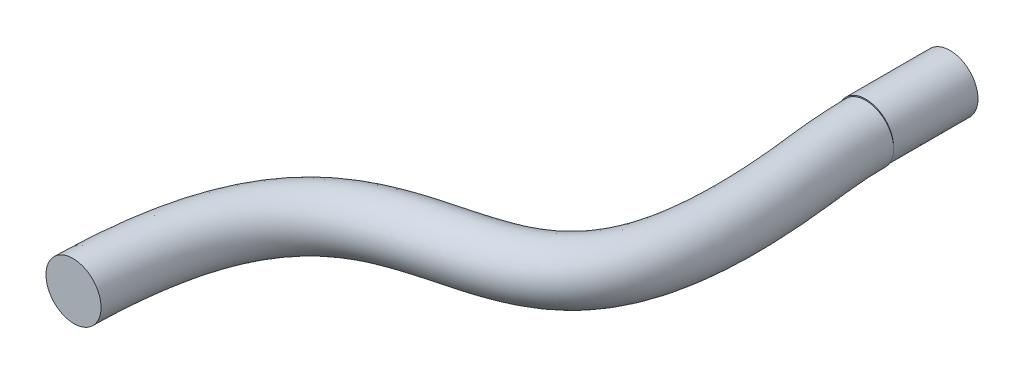
ISO-10303-21;
HEADER;
FILE_DESCRIPTION(('STEP AP214'),'2;1');
FILE_NAME('part.step','',(''),(''),'','','');
FILE_SCHEMA(('AUTOMOTIVE_DESIGN { 1 0 10303 214 1 1 1 1 }'));
ENDSEC;
DATA;
#1=APPLICATION_CONTEXT('core data for automotive mechanical design processes');
#2=APPLICATION_PROTOCOL_DEFINITION('international standard','automotive_design',2000,#1);
#3=PRODUCT_CONTEXT('',#1,'mechanical');
#4=PRODUCT('Part','Part','',(#3));
#5=PRODUCT_RELATED_PRODUCT_CATEGORY('part','',(#4));
#6=PRODUCT_DEFINITION_FORMATION('','',#4);
#7=PRODUCT_DEFINITION_CONTEXT('part definition',#1,'design');
#8=PRODUCT_DEFINITION('design','',#6,#7);
#9=PRODUCT_DEFINITION_SHAPE('','',#8);
#10=(LENGTH_UNIT() NAMED_UNIT(*) SI_UNIT(.MILLI.,.METRE.));
#11=(NAMED_UNIT(*) PLANE_ANGLE_UNIT() SI_UNIT($,.RADIAN.));
#12=(NAMED_UNIT(*) SI_UNIT($,.STERADIAN.) SOLID_ANGLE_UNIT());
#13=UNCERTAINTY_MEASURE_WITH_UNIT(LENGTH_MEASURE(1.E-05),#10,'distance_accuracy_value','');
#14=(GEOMETRIC_REPRESENTATION_CONTEXT(3) GLOBAL_UNCERTAINTY_ASSIGNED_CONTEXT((#13)) GLOBAL_UNIT_ASSIGNED_CONTEXT((#10,
#11,#12)) REPRESENTATION_CONTEXT('',''));
#15=CARTESIAN_POINT('',(0.,0.,0.));
#16=DIRECTION('',(0.,0.,1.));
#17=DIRECTION('',(1.,0.,0.));
#18=AXIS2_PLACEMENT_3D('',#15,#16,#17);
#19=CARTESIAN_POINT('',(-2.5,3.2,13.5869137408022));
#20=CARTESIAN_POINT('',(-2.5,2.53788831569843,13.5869137408022));
#21=CARTESIAN_POINT('',(-2.22780166235712,1.89216147929993,13.6420845102468));
#22=CARTESIAN_POINT('',(-1.30732387428513,0.971896292639807,13.760831163823));
#23=CARTESIAN_POINT('',(-0.655114910064383,0.700380474031432,13.814931148395));
#24=CARTESIAN_POINT('',(0.652207812988912,0.699620371089979,13.8150686986695));
#25=CARTESIAN_POINT('',(1.30199582888107,0.96669213638215,13.7615104619691));
#26=CARTESIAN_POINT('',(2.23266360072322,1.89689969759551,13.64146533842));
#27=CARTESIAN_POINT('',(2.49973964777646,2.54570634281856,13.5869616457583));
#28=CARTESIAN_POINT('',(2.5002599557829,3.85230257549849,13.5868659087915));
#29=CARTESIAN_POINT('',(2.22986932022129,4.50481379970339,13.6417550461998));
#30=CARTESIAN_POINT('',(1.30892049703576,5.42746119373609,13.7606876666183));
#31=CARTESIAN_POINT('',(0.662474748784472,5.69949655436872,13.8149088951339));
#32=CARTESIAN_POINT('',(-0.658669551205649,5.70050199767821,13.8150908428407));
#33=CARTESIAN_POINT('',(-1.3062260560479,5.42862869370346,13.7609351890636));
#34=CARTESIAN_POINT('',(-2.22670002624203,4.5095111137484,13.6422641368741));
#35=CARTESIAN_POINT('',(-2.5,3.86211168430157,13.5869137408022));
#36=CARTESIAN_POINT('',(-2.5,3.2,13.5869137408022));
#37=B_SPLINE_CURVE_WITH_KNOTS('',3,(#19,#20,#21,#22,#23,#24,#25,#26,#27,#28,#29,#30,#31,#32,#33,
#34,#35,#36),.UNSPECIFIED.,.T.,.F.,(4,2,2,2,2,2,2,2,4),(0.,0.125,0.25,0.375,0.5,0.625,0.75,
0.875,1.),.UNSPECIFIED.);
#38=DIRECTION('',(0.,0.,1.));
#39=VECTOR('',#38,1.);
#40=SURFACE_OF_LINEAR_EXTRUSION('',#37,#39);
#41=CARTESIAN_POINT('',(-2.5,3.2,23.815));
#42=CARTESIAN_POINT('',(-2.5000041662946,3.05918614106118,23.815));
#43=CARTESIAN_POINT('',(-2.48765106627318,2.91827025999956,23.815));
#44=CARTESIAN_POINT('',(-2.43936797104365,2.64033458560522,23.815));
#45=CARTESIAN_POINT('',(-2.40338802511214,2.50332368974738,23.815));
#46=CARTESIAN_POINT('',(-2.30937095618249,2.237337002839,23.815));
#47=CARTESIAN_POINT('',(-2.25136655797398,2.10834961947485,23.815));
#48=CARTESIAN_POINT('',(-2.11481548389377,1.86182623685901,23.815));
#49=CARTESIAN_POINT('',(-2.03629207201474,1.74427747458064,23.815));
#50=CARTESIAN_POINT('',(-1.90401663359866,1.57870559677719,23.815));
#51=CARTESIAN_POINT('',(-1.85719360130458,1.52502604799747,23.815));
#52=CARTESIAN_POINT('',(-1.75896227521253,1.4220168950411,23.815));
#53=CARTESIAN_POINT('',(-1.70755430133438,1.37268698783988,23.815));
#54=CARTESIAN_POINT('',(-1.6005411340742,1.27876524406056,23.815));
#55=CARTESIAN_POINT('',(-1.54493393391209,1.23417569768975,23.815));
#56=CARTESIAN_POINT('',(-1.43011553214778,1.14992969022768,23.815));
#57=CARTESIAN_POINT('',(-1.37090396628532,1.11027372896552,23.815));
#58=CARTESIAN_POINT('',(-1.19279516492542,1.00155940875247,23.815));
#59=CARTESIAN_POINT('',(-1.06957825269427,0.939434078587153,23.815));
#60=CARTESIAN_POINT('',(-0.814830323685333,0.835574714620745,23.815));
#61=CARTESIAN_POINT('',(-0.683299370997215,0.793840523654041,23.815));
#62=CARTESIAN_POINT('',(-0.47899114979032,0.746870609871643,23.815));
#63=CARTESIAN_POINT('',(-0.407960573469447,0.733713349946262,23.815));
#64=CARTESIAN_POINT('',(-0.265008755474225,0.713641427644063,23.815));
#65=CARTESIAN_POINT('',(-0.193087596301686,0.706726191340002,23.815));
#66=CARTESIAN_POINT('',(-0.048943285077449,0.699429797963249,23.815));
#67=CARTESIAN_POINT('',(0.023279714661015,0.699045669014181,23.815));
#68=CARTESIAN_POINT('',(0.167452271012969,0.704741629508866,23.815));
#69=CARTESIAN_POINT('',(0.239401812083291,0.710822081038728,23.815));
#70=CARTESIAN_POINT('',(0.447146139345857,0.737567032272908,23.815));
#71=CARTESIAN_POINT('',(0.581969264170643,0.766440448680233,23.815));
#72=CARTESIAN_POINT('',(0.845218947807997,0.845501891870066,23.815));
#73=CARTESIAN_POINT('',(0.973639804053716,0.895708554356996,23.815));
#74=CARTESIAN_POINT('',(1.22545577591637,1.01840733214018,23.815));
#75=CARTESIAN_POINT('',(1.34848616555078,1.09165905764615,23.815));
#76=CARTESIAN_POINT('',(1.52215538024478,1.21632625171174,23.815));
#77=CARTESIAN_POINT('',(1.5782295364486,1.26034402003001,23.815));
#78=CARTESIAN_POINT('',(1.68632118975579,1.35310325454462,23.815));
#79=CARTESIAN_POINT('',(1.73833911791209,1.40184421757187,23.815));
#80=CARTESIAN_POINT('',(1.88567139420892,1.55275116062108,23.815));
#81=CARTESIAN_POINT('',(1.97460290707358,1.66128003707524,23.815));
#82=CARTESIAN_POINT('',(2.13317911731419,1.89163545929618,23.815));
#83=CARTESIAN_POINT('',(2.20280154972212,2.01347713210861,23.815));
#84=CARTESIAN_POINT('',(2.32136642401394,2.2672636352186,23.815));
#85=CARTESIAN_POINT('',(2.37026247230706,2.3992303582183,23.815));
#86=CARTESIAN_POINT('',(2.42677610789178,2.60166115162513,23.815));
#87=CARTESIAN_POINT('',(2.44280854271992,2.66988143752874,23.815));
#88=CARTESIAN_POINT('',(2.46911253515691,2.80744292765786,23.815));
#89=CARTESIAN_POINT('',(2.47938416794977,2.87678411724235,23.815));
#90=CARTESIAN_POINT('',(2.49411279997847,3.01721701763673,23.815));
#91=CARTESIAN_POINT('',(2.49847304418756,3.08831890006944,23.815));
#92=CARTESIAN_POINT('',(2.50084468348798,3.2306282906834,23.815));
#93=CARTESIAN_POINT('',(2.49885635438736,3.30183579414172,23.815));
#94=CARTESIAN_POINT('',(2.48859759067391,3.4438345687877,23.815));
#95=CARTESIAN_POINT('',(2.48032373598441,3.51462559222058,23.815));
#96=CARTESIAN_POINT('',(2.45775423528108,3.65522683986511,23.815));
#97=CARTESIAN_POINT('',(2.44345806588499,3.72503697828581,23.815));
#98=CARTESIAN_POINT('',(2.39302706589602,3.92754641416262,23.815));
#99=CARTESIAN_POINT('',(2.34894765456753,4.05834514586136,23.815));
#100=CARTESIAN_POINT('',(2.24053034875994,4.31124589096949,23.815));
#101=CARTESIAN_POINT('',(2.17619455496702,4.43334880456856,23.815));
#102=CARTESIAN_POINT('',(2.06372549911455,4.61024345413192,23.815));
#103=CARTESIAN_POINT('',(2.02241249576878,4.66945777319497,23.815));
#104=CARTESIAN_POINT('',(1.93476538768999,4.78406429551613,23.815));
#105=CARTESIAN_POINT('',(1.88843176222452,4.83945686277311,23.815));
#106=CARTESIAN_POINT('',(1.7909532067705,4.94580007217778,23.815));
#107=CARTESIAN_POINT('',(1.73981004657325,4.99675233505456,23.815));
#108=CARTESIAN_POINT('',(1.63320451047273,5.09389105389512,23.815));
#109=CARTESIAN_POINT('',(1.5777418396474,5.1400771839415,23.815));
#110=CARTESIAN_POINT('',(1.41107746247771,5.26698292063376,23.815));
#111=CARTESIAN_POINT('',(1.2948068411046,5.34118313310697,23.815));
#112=CARTESIAN_POINT('',(1.0518185486062,5.46989321796449,23.815));
#113=CARTESIAN_POINT('',(0.925092789818453,5.52438766801995,23.815));
#114=CARTESIAN_POINT('',(0.659687798952423,5.61389952802596,23.815));
#115=CARTESIAN_POINT('',(0.520740457188254,5.64812782003944,23.815));
#116=CARTESIAN_POINT('',(0.239135491199177,5.69229539006486,23.815));
#117=CARTESIAN_POINT('',(0.096481902709365,5.70226005361185,23.815));
#118=CARTESIAN_POINT('',(-0.185485738806542,5.69691476337896,23.815));
#119=CARTESIAN_POINT('',(-0.324809544223591,5.68210607294643,23.815));
#120=CARTESIAN_POINT('',(-0.599144169414999,5.62955639332557,23.815));
#121=CARTESIAN_POINT('',(-0.734150101559754,5.5917903216498,23.815));
#122=CARTESIAN_POINT('',(-0.996820858132526,5.49450378997828,23.815));
#123=CARTESIAN_POINT('',(-1.12445173425854,5.43489077362899,23.815));
#124=CARTESIAN_POINT('',(-1.30706241072358,5.33043233115569,23.815));
#125=CARTESIAN_POINT('',(-1.3664588409306,5.29310733381342,23.815));
#126=CARTESIAN_POINT('',(-1.48192927186167,5.21360212158318,23.815));
#127=CARTESIAN_POINT('',(-1.5380034183849,5.17142211999759,23.815));
#128=CARTESIAN_POINT('',(-1.64715085710353,5.08176481465552,23.815));
#129=CARTESIAN_POINT('',(-1.70016717423907,5.03421810707848,23.815));
#130=CARTESIAN_POINT('',(-1.80175907098532,4.93459530840385,23.815));
#131=CARTESIAN_POINT('',(-1.85033464644493,4.8825192130724,23.815));
#132=CARTESIAN_POINT('',(-1.9427937533644,4.77429601335267,23.815));
#133=CARTESIAN_POINT('',(-1.98667406018077,4.71814615501308,23.815));
#134=CARTESIAN_POINT('',(-2.06947577705181,4.60231967471397,23.815));
#135=CARTESIAN_POINT('',(-2.1083968792285,4.54264283412823,23.815));
#136=CARTESIAN_POINT('',(-2.21521659904764,4.36271287785753,23.815));
#137=CARTESIAN_POINT('',(-2.27603753455201,4.23816196980664,23.815));
#138=CARTESIAN_POINT('',(-2.3767285139482,3.98105516306154,23.815));
#139=CARTESIAN_POINT('',(-2.41662486508519,3.84850955066495,23.815));
#140=CARTESIAN_POINT('',(-2.46340955660078,3.62928901351915,23.815));
#141=CARTESIAN_POINT('',(-2.47706318907414,3.54401256264352,23.815));
#142=CARTESIAN_POINT('',(-2.49535658394455,3.37250342713781,23.815));
#143=CARTESIAN_POINT('',(-2.49999744748263,3.28627086061666,23.815));
#144=CARTESIAN_POINT('',(-2.5,3.2,23.815));
#145=B_SPLINE_CURVE_WITH_KNOTS('',3,(#41,#42,#43,#44,#45,#46,#47,#48,#49,#50,#51,#52,#53,#54,
#55,#56,#57,#58,#59,#60,#61,#62,#63,#64,#65,#66,#67,#68,#69,#70,#71,#72,#73,#74,#75,#76,#77,#78,
#79,#80,#81,#82,#83,#84,#85,#86,#87,#88,#89,#90,#91,#92,#93,#94,#95,#96,#97,#98,#99,#100,#101,
#102,#103,#104,#105,#106,#107,#108,#109,#110,#111,#112,#113,#114,#115,#116,#117,#118,#119,#120,
#121,#122,#123,#124,#125,#126,#127,#128,#129,#130,#131,#132,#133,#134,#135,#136,#137,#138,#139,
#140,#141,#142,#143,#144),.UNSPECIFIED.,.T.,.F.,(4,2,2,2,2,2,2,2,2,2,2,2,2,2,2,2,2,2,2,2,2,2,2,
2,2,2,2,2,2,2,2,2,2,2,2,2,2,2,2,2,2,2,2,2,2,2,2,2,2,2,2,4),(0.,0.422128290576456,
0.845151909889732,1.26754942834417,1.68947010441112,1.90293385233962,2.11638271721345,
2.32993424128109,2.5435073829937,2.95560151470471,3.36769247013167,3.58417712867932,
3.80064188036498,4.01700813057572,4.23338650026442,4.64500912544378,5.05699206611661,
5.48430231247539,5.69793335802055,5.9115416700942,6.33024293813642,6.74942501487928,
7.16954048943339,7.3795777781942,7.58961232570259,7.80304472719045,8.01646785642592,
8.23000719658461,8.4435650986703,8.85575957797663,9.26791132476595,9.48428458887236,
9.70063721619737,9.91691054025732,10.1331986437199,10.5449829781666,10.9570888935999,
11.3843351130138,11.8111341386799,12.2294013552718,12.6481263804234,13.0686462720542,
13.2788971241565,13.4891387425074,13.7025045555385,13.9158705680162,14.1293821891947,
14.342907059177,14.7567865712282,15.1701444820395,15.4287967292925,15.6874173735467),.UNSPECIFIED.);
#146=CARTESIAN_POINT('',(-2.49949168792326,3.15041132811728,23.815));
#147=VERTEX_POINT('',#146);
#148=CARTESIAN_POINT('',(2.49949046134546,3.150472107575,23.815));
#149=VERTEX_POINT('',#148);
#150=EDGE_CURVE('E62',#147,#149,#145,.T.);
#151=ORIENTED_EDGE('',*,*,#150,.F.);
#152=EDGE_CURVE('E86',#149,#147,#145,.T.);
#153=ORIENTED_EDGE('',*,*,#152,.F.);
#154=EDGE_LOOP('',(#151,#153));
#155=FACE_BOUND('',#154,.T.);
#156=CARTESIAN_POINT('',(-2.5,3.2,16.2959202998008));
#157=CARTESIAN_POINT('',(-2.5000041662946,3.05918614106118,16.2959202998008));
#158=CARTESIAN_POINT('',(-2.48765106627318,2.91827025999956,16.2959202998008));
#159=CARTESIAN_POINT('',(-2.43936797104365,2.64033458560522,16.2959202998008));
#160=CARTESIAN_POINT('',(-2.40338802511214,2.50332368974738,16.2959202998008));
#161=CARTESIAN_POINT('',(-2.30937095618249,2.237337002839,16.2959202998008));
#162=CARTESIAN_POINT('',(-2.25136655797398,2.10834961947485,16.2959202998008));
#163=CARTESIAN_POINT('',(-2.11481548389377,1.86182623685901,16.2959202998008));
#164=CARTESIAN_POINT('',(-2.03629207201474,1.74427747458064,16.2959202998008));
#165=CARTESIAN_POINT('',(-1.90401663359866,1.57870559677719,16.2959202998008));
#166=CARTESIAN_POINT('',(-1.85719360130458,1.52502604799747,16.2959202998008));
#167=CARTESIAN_POINT('',(-1.75896227521253,1.4220168950411,16.2959202998008));
#168=CARTESIAN_POINT('',(-1.70755430133438,1.37268698783988,16.2959202998008));
#169=CARTESIAN_POINT('',(-1.6005411340742,1.27876524406056,16.2959202998008));
#170=CARTESIAN_POINT('',(-1.54493393391209,1.23417569768975,16.2959202998008));
#171=CARTESIAN_POINT('',(-1.43011553214778,1.14992969022769,16.2959202998008));
#172=CARTESIAN_POINT('',(-1.37090396628532,1.11027372896552,16.2959202998008));
#173=CARTESIAN_POINT('',(-1.19279516492543,1.00155940875248,16.2959202998008));
#174=CARTESIAN_POINT('',(-1.06957825269427,0.939434078587154,16.2959202998008));
#175=CARTESIAN_POINT('',(-0.814830323685334,0.835574714620745,16.2959202998008));
#176=CARTESIAN_POINT('',(-0.683299370997215,0.793840523654041,16.2959202998008));
#177=CARTESIAN_POINT('',(-0.478991149790321,0.746870609871643,16.2959202998008));
#178=CARTESIAN_POINT('',(-0.407960573469448,0.733713349946262,16.2959202998008));
#179=CARTESIAN_POINT('',(-0.265008755474226,0.713641427644063,16.2959202998008));
#180=CARTESIAN_POINT('',(-0.193087596301687,0.706726191340002,16.2959202998008));
#181=CARTESIAN_POINT('',(-0.0489432850774501,0.699429797963249,16.2959202998008));
#182=CARTESIAN_POINT('',(0.0232797146610138,0.69904566901418,16.2959202998008));
#183=CARTESIAN_POINT('',(0.167452271012968,0.704741629508866,16.2959202998008));
#184=CARTESIAN_POINT('',(0.23940181208329,0.710822081038727,16.2959202998008));
#185=CARTESIAN_POINT('',(0.447146139345855,0.737567032272908,16.2959202998008));
#186=CARTESIAN_POINT('',(0.581969264170641,0.766440448680233,16.2959202998008));
#187=CARTESIAN_POINT('',(0.845218947807996,0.845501891870065,16.2959202998008));
#188=CARTESIAN_POINT('',(0.973639804053714,0.895708554356995,16.2959202998008));
#189=CARTESIAN_POINT('',(1.22545577591636,1.01840733214018,16.2959202998008));
#190=CARTESIAN_POINT('',(1.34848616555078,1.09165905764615,16.2959202998008));
#191=CARTESIAN_POINT('',(1.52215538024478,1.21632625171174,16.2959202998008));
#192=CARTESIAN_POINT('',(1.5782295364486,1.26034402003001,16.2959202998008));
#193=CARTESIAN_POINT('',(1.68632118975579,1.35310325454462,16.2959202998008));
#194=CARTESIAN_POINT('',(1.73833911791209,1.40184421757187,16.2959202998008));
#195=CARTESIAN_POINT('',(1.88567139420891,1.55275116062108,16.2959202998008));
#196=CARTESIAN_POINT('',(1.97460290707358,1.66128003707524,16.2959202998008));
#197=CARTESIAN_POINT('',(2.13317911731419,1.89163545929618,16.2959202998008));
#198=CARTESIAN_POINT('',(2.20280154972212,2.01347713210861,16.2959202998008));
#199=CARTESIAN_POINT('',(2.32136642401394,2.2672636352186,16.2959202998008));
#200=CARTESIAN_POINT('',(2.37026247230706,2.3992303582183,16.2959202998008));
#201=CARTESIAN_POINT('',(2.42677610789178,2.60166115162513,16.2959202998008));
#202=CARTESIAN_POINT('',(2.44280854271992,2.66988143752874,16.2959202998008));
#203=CARTESIAN_POINT('',(2.46911253515691,2.80744292765785,16.2959202998008));
#204=CARTESIAN_POINT('',(2.47938416794977,2.87678411724234,16.2959202998008));
#205=CARTESIAN_POINT('',(2.49411279997847,3.01721701763673,16.2959202998008));
#206=CARTESIAN_POINT('',(2.49847304418756,3.08831890006943,16.2959202998008));
#207=CARTESIAN_POINT('',(2.50084468348798,3.2306282906834,16.2959202998008));
#208=CARTESIAN_POINT('',(2.49885635438736,3.30183579414172,16.2959202998008));
#209=CARTESIAN_POINT('',(2.48859759067391,3.4438345687877,16.2959202998008));
#210=CARTESIAN_POINT('',(2.48032373598441,3.51462559222058,16.2959202998008));
#211=CARTESIAN_POINT('',(2.45775423528108,3.65522683986511,16.2959202998008));
#212=CARTESIAN_POINT('',(2.443458065885,3.7250369782858,16.2959202998008));
#213=CARTESIAN_POINT('',(2.39302706589602,3.92754641416262,16.2959202998008));
#214=CARTESIAN_POINT('',(2.34894765456753,4.05834514586135,16.2959202998008));
#215=CARTESIAN_POINT('',(2.24053034875994,4.31124589096949,16.2959202998008));
#216=CARTESIAN_POINT('',(2.17619455496702,4.43334880456856,16.2959202998008));
#217=CARTESIAN_POINT('',(2.06372549911455,4.61024345413192,16.2959202998008));
#218=CARTESIAN_POINT('',(2.02241249576878,4.66945777319497,16.2959202998008));
#219=CARTESIAN_POINT('',(1.93476538768999,4.78406429551613,16.2959202998008));
#220=CARTESIAN_POINT('',(1.88843176222452,4.83945686277311,16.2959202998008));
#221=CARTESIAN_POINT('',(1.7909532067705,4.94580007217778,16.2959202998008));
#222=CARTESIAN_POINT('',(1.73981004657326,4.99675233505456,16.2959202998008));
#223=CARTESIAN_POINT('',(1.63320451047273,5.09389105389512,16.2959202998008));
#224=CARTESIAN_POINT('',(1.5777418396474,5.1400771839415,16.2959202998008));
#225=CARTESIAN_POINT('',(1.41107746247771,5.26698292063375,16.2959202998008));
#226=CARTESIAN_POINT('',(1.2948068411046,5.34118313310696,16.2959202998008));
#227=CARTESIAN_POINT('',(1.0518185486062,5.46989321796449,16.2959202998008));
#228=CARTESIAN_POINT('',(0.925092789818455,5.52438766801995,16.2959202998008));
#229=CARTESIAN_POINT('',(0.659687798952426,5.61389952802596,16.2959202998008));
#230=CARTESIAN_POINT('',(0.520740457188256,5.64812782003943,16.2959202998008));
#231=CARTESIAN_POINT('',(0.23913549119918,5.69229539006486,16.2959202998008));
#232=CARTESIAN_POINT('',(0.0964819027093682,5.70226005361185,16.2959202998008));
#233=CARTESIAN_POINT('',(-0.185485738806538,5.69691476337896,16.2959202998008));
#234=CARTESIAN_POINT('',(-0.324809544223588,5.68210607294643,16.2959202998008));
#235=CARTESIAN_POINT('',(-0.599144169414996,5.62955639332557,16.2959202998008));
#236=CARTESIAN_POINT('',(-0.734150101559752,5.5917903216498,16.2959202998008));
#237=CARTESIAN_POINT('',(-0.996820858132526,5.49450378997828,16.2959202998008));
#238=CARTESIAN_POINT('',(-1.12445173425855,5.43489077362899,16.2959202998008));
#239=CARTESIAN_POINT('',(-1.30706241072359,5.33043233115569,16.2959202998008));
#240=CARTESIAN_POINT('',(-1.3664588409306,5.29310733381342,16.2959202998008));
#241=CARTESIAN_POINT('',(-1.48192927186167,5.21360212158318,16.2959202998008));
#242=CARTESIAN_POINT('',(-1.5380034183849,5.17142211999759,16.2959202998008));
#243=CARTESIAN_POINT('',(-1.64715085710353,5.08176481465552,16.2959202998008));
#244=CARTESIAN_POINT('',(-1.70016717423908,5.03421810707848,16.2959202998008));
#245=CARTESIAN_POINT('',(-1.80175907098532,4.93459530840385,16.2959202998008));
#246=CARTESIAN_POINT('',(-1.85033464644493,4.8825192130724,16.2959202998008));
#247=CARTESIAN_POINT('',(-1.9427937533644,4.77429601335266,16.2959202998008));
#248=CARTESIAN_POINT('',(-1.98667406018077,4.71814615501308,16.2959202998008));
#249=CARTESIAN_POINT('',(-2.06947577705181,4.60231967471397,16.2959202998008));
#250=CARTESIAN_POINT('',(-2.1083968792285,4.54264283412824,16.2959202998008));
#251=CARTESIAN_POINT('',(-2.21521659904764,4.36271287785753,16.2959202998008));
#252=CARTESIAN_POINT('',(-2.27603753455201,4.23816196980664,16.2959202998008));
#253=CARTESIAN_POINT('',(-2.3767285139482,3.98105516306154,16.2959202998008));
#254=CARTESIAN_POINT('',(-2.41662486508519,3.84850955066495,16.2959202998008));
#255=CARTESIAN_POINT('',(-2.46340955660078,3.62928901351915,16.2959202998008));
#256=CARTESIAN_POINT('',(-2.47706318907414,3.54401256264352,16.2959202998008));
#257=CARTESIAN_POINT('',(-2.49535658394455,3.37250342713781,16.2959202998008));
#258=CARTESIAN_POINT('',(-2.49999744748263,3.28627086061666,16.2959202998008));
#259=CARTESIAN_POINT('',(-2.5,3.2,16.2959202998008));
#260=B_SPLINE_CURVE_WITH_KNOTS('',3,(#156,#157,#158,#159,#160,#161,#162,#163,#164,#165,#166,
#167,#168,#169,#170,#171,#172,#173,#174,#175,#176,#177,#178,#179,#180,#181,#182,#183,#184,#185,
#186,#187,#188,#189,#190,#191,#192,#193,#194,#195,#196,#197,#198,#199,#200,#201,#202,#203,#204,
#205,#206,#207,#208,#209,#210,#211,#212,#213,#214,#215,#216,#217,#218,#219,#220,#221,#222,#223,
#224,#225,#226,#227,#228,#229,#230,#231,#232,#233,#234,#235,#236,#237,#238,#239,#240,#241,#242,
#243,#244,#245,#246,#247,#248,#249,#250,#251,#252,#253,#254,#255,#256,#257,#258,#259),
.UNSPECIFIED.,.T.,.F.,(4,2,2,2,2,2,2,2,2,2,2,2,2,2,2,2,2,2,2,2,2,2,2,2,2,2,2,2,2,2,2,2,2,2,2,2,
2,2,2,2,2,2,2,2,2,2,2,2,2,2,2,4),(0.,0.422128290576457,0.845151909889733,1.26754942834417,
1.68947010441113,1.90293385233962,2.11638271721345,2.32993424128109,2.54350738299369,
2.9556015147047,3.36769247013167,3.58417712867932,3.80064188036498,4.01700813057572,
4.23338650026442,4.64500912544378,5.05699206611661,5.48430231247538,5.69793335802055,
5.9115416700942,6.33024293813642,6.74942501487928,7.16954048943339,7.37957777819419,
7.58961232570259,7.80304472719045,8.01646785642592,8.23000719658461,8.44356509867029,
8.85575957797663,9.26791132476596,9.48428458887236,9.70063721619738,9.91691054025732,
10.1331986437199,10.5449829781666,10.9570888935999,11.3843351130138,11.8111341386799,
12.2294013552718,12.6481263804234,13.0686462720542,13.2788971241565,13.4891387425074,
13.7025045555385,13.9158705680162,14.1293821891947,14.342907059177,14.7567865712283,
15.1701444820395,15.4287967292925,15.6874173735467),.UNSPECIFIED.);
#261=CARTESIAN_POINT('',(-2.5,3.2,16.2959202998008));
#262=VERTEX_POINT('',#261);
#263=EDGE_CURVE('E52',#262,#262,#260,.T.);
#264=ORIENTED_EDGE('',*,*,#263,.T.);
#265=EDGE_LOOP('',(#264));
#266=FACE_BOUND('',#265,.T.);
#267=ADVANCED_FACE('F47',(#155,#266),#40,.T.);
#268=CARTESIAN_POINT('',(-3.92052626226036,0.,23.815));
#269=DIRECTION('',(0.,0.,-1.));
#270=DIRECTION('',(-1.,0.,0.));
#271=AXIS2_PLACEMENT_3D('',#268,#269,#270);
#272=PLANE('',#271);
#273=CARTESIAN_POINT('',(0.,3.1,23.815));
#274=DIRECTION('',(0.,0.,1.));
#275=DIRECTION('',(1.,0.,0.));
#276=AXIS2_PLACEMENT_3D('',#273,#274,#275);
#277=CIRCLE('',#276,2.5);
#278=EDGE_CURVE('E11',#149,#147,#277,.T.);
#279=ORIENTED_EDGE('',*,*,#278,.F.);
#280=ORIENTED_EDGE('',*,*,#152,.T.);
#281=EDGE_LOOP('',(#279,#280));
#282=FACE_BOUND('',#281,.T.);
#283=ADVANCED_FACE('F102',(#282),#272,.F.);
#284=CARTESIAN_POINT('',(0.,3.1,23.815));
#285=DIRECTION('',(0.,0.,1.));
#286=DIRECTION('',(1.,0.,0.));
#287=AXIS2_PLACEMENT_3D('',#284,#285,#286);
#288=PLANE('',#287);
#289=CARTESIAN_POINT('',(2.5,3.1,23.815));
#290=VERTEX_POINT('',#289);
#291=EDGE_CURVE('E65',#147,#290,#277,.T.);
#292=ORIENTED_EDGE('',*,*,#291,.F.);
#293=ORIENTED_EDGE('',*,*,#150,.T.);
#294=EDGE_CURVE('E64',#290,#149,#277,.T.);
#295=ORIENTED_EDGE('',*,*,#294,.F.);
#296=EDGE_LOOP('',(#292,#293,#295));
#297=FACE_BOUND('',#296,.T.);
#298=ADVANCED_FACE('F106',(#297),#288,.F.);
#299=CARTESIAN_POINT('',(-23.1033726652444,3.1,71.3962633375867));
#300=DIRECTION('',(-0.0167181008045667,0.,0.999860242786705));
#301=DIRECTION('',(0.999860242786705,0.,0.0167181008045667));
#302=AXIS2_PLACEMENT_3D('',#299,#300,#301);
#303=PLANE('',#302);
#304=CARTESIAN_POINT('',(-23.1033726652444,3.1,71.3962633375867));
#305=DIRECTION('',(-0.0167181008045667,0.,0.999860242786705));
#306=DIRECTION('',(0.999860242786705,0.,0.0167181008045667));
#307=AXIS2_PLACEMENT_3D('',#304,#305,#306);
#308=CIRCLE('',#307,2.5);
#309=CARTESIAN_POINT('',(-20.6037220582776,3.1,71.4380585895981));
#310=VERTEX_POINT('',#309);
#311=EDGE_CURVE('E82',#310,#310,#308,.T.);
#312=ORIENTED_EDGE('',*,*,#311,.T.);
#313=EDGE_LOOP('',(#312));
#314=FACE_BOUND('',#313,.T.);
#315=ADVANCED_FACE('F83',(#314),#303,.T.);
#316=CARTESIAN_POINT('',(2.5,3.1,23.815));
#317=CARTESIAN_POINT('',(2.50000000414007,3.09999999999264,25.8299978039131));
#318=CARTESIAN_POINT('',(2.81657399147906,3.1,28.102557448462));
#319=CARTESIAN_POINT('',(3.50630987838524,3.1,34.704669448896));
#320=CARTESIAN_POINT('',(3.49498913147129,3.09999999999886,38.2088868708138));
#321=CARTESIAN_POINT('',(2.62979592867574,3.10000000000113,43.971162960853));
#322=CARTESIAN_POINT('',(1.75353100909346,3.10000000000037,46.2558837306201));
#323=CARTESIAN_POINT('',(-0.808909762091462,3.09999999999963,49.7953125321718));
#324=CARTESIAN_POINT('',(-2.46819917071715,3.1,50.9797228894429));
#325=CARTESIAN_POINT('',(-5.80662436998137,3.1,52.5646347903395));
#326=CARTESIAN_POINT('',(-7.49121723798469,3.09999999999965,53.0123299771268));
#327=CARTESIAN_POINT('',(-10.6549485843522,3.10000000000035,53.8605644745865));
#328=CARTESIAN_POINT('',(-12.1369280983858,3.1,54.2584844661936));
#329=CARTESIAN_POINT('',(-14.7311961305286,3.1,55.3790404126647));
#330=CARTESIAN_POINT('',(-15.8370043938307,3.09999999999919,56.074557536643));
#331=CARTESIAN_POINT('',(-17.8041487976403,3.10000000000081,58.2223774398343));
#332=CARTESIAN_POINT('',(-18.694786125952,3.1,59.7083613710796));
#333=CARTESIAN_POINT('',(-20.0717219708307,3.1,64.276145432993));
#334=CARTESIAN_POINT('',(-20.535362054469,3.1,67.3496486544315));
#335=CARTESIAN_POINT('',(-20.6037220582776,3.1,71.4380585895981));
#336=CARTESIAN_POINT('',(2.5,8.1,23.815));
#337=CARTESIAN_POINT('',(2.50000000414007,8.09999999999202,25.8299978038954));
#338=CARTESIAN_POINT('',(2.81657399147906,8.1,28.102557448462));
#339=CARTESIAN_POINT('',(3.50630987838524,8.1,34.704669448896));
#340=CARTESIAN_POINT('',(3.49498913147129,8.09999999999943,38.2088868708138));
#341=CARTESIAN_POINT('',(2.62979592867574,8.10000000000057,43.971162960853));
#342=CARTESIAN_POINT('',(1.75353100909346,8.10000000000028,46.2558837306201));
#343=CARTESIAN_POINT('',(-0.808909762091462,8.09999999999972,49.7953125321718));
#344=CARTESIAN_POINT('',(-2.46819917071715,8.1,50.9797228894429));
#345=CARTESIAN_POINT('',(-5.80662436998137,8.1,52.5646347903395));
#346=CARTESIAN_POINT('',(-7.49121723798469,8.09999999999982,53.0123299771268));
#347=CARTESIAN_POINT('',(-10.6549485843522,8.10000000000018,53.8605644745865));
#348=CARTESIAN_POINT('',(-12.1369280983858,8.1,54.2584844661936));
#349=CARTESIAN_POINT('',(-14.7311961305286,8.1,55.3790404126647));
#350=CARTESIAN_POINT('',(-15.8370043938307,8.09999999999797,56.074557536643));
#351=CARTESIAN_POINT('',(-17.8041487976403,8.10000000000203,58.2223774398343));
#352=CARTESIAN_POINT('',(-18.694786125952,8.1,59.7083613710796));
#353=CARTESIAN_POINT('',(-20.0717219708307,8.1,64.276145432993));
#354=CARTESIAN_POINT('',(-20.535362054469,8.1,67.3496486544315));
#355=CARTESIAN_POINT('',(-20.6037220582776,8.1,71.4380585895981));
#356=CARTESIAN_POINT('',(-2.5,8.1,23.815));
#357=CARTESIAN_POINT('',(-2.49999999102044,8.09999999999202,26.3270223614918));
#358=CARTESIAN_POINT('',(-2.14156192612057,8.1,28.7637492484771));
#359=CARTESIAN_POINT('',(-1.49646188481563,8.1,34.9386095093341));
#360=CARTESIAN_POINT('',(-1.53760617632688,8.09999999999943,38.0526975253586));
#361=CARTESIAN_POINT('',(-2.22675773930478,8.10000000000057,42.6425181287465));
#362=CARTESIAN_POINT('',(-2.85237254741767,8.10000000000028,44.091588603061));
#363=CARTESIAN_POINT('',(-4.303072993011,8.09999999999972,46.0954011457034));
#364=CARTESIAN_POINT('',(-5.15504508921733,8.1,46.720440854334));
#365=CARTESIAN_POINT('',(-7.40849175108499,8.1,47.7902609634067));
#366=CARTESIAN_POINT('',(-8.8045092588462,8.09999999999982,48.1878476781738));
#367=CARTESIAN_POINT('',(-11.9313146112419,8.10000000000018,49.0261818715069));
#368=CARTESIAN_POINT('',(-13.6592614388663,8.1,49.4695486284132));
#369=CARTESIAN_POINT('',(-17.1741291341363,8.1,50.9877440736186));
#370=CARTESIAN_POINT('',(-18.9675302737737,8.09999999999797,52.089691555331));
#371=CARTESIAN_POINT('',(-22.0480548184499,8.10000000000203,55.453151761925));
#372=CARTESIAN_POINT('',(-23.3058770490062,8.1,57.6809833055057));
#373=CARTESIAN_POINT('',(-25.0350775661865,8.1,63.4173540880667));
#374=CARTESIAN_POINT('',(-25.5291142917072,8.1,66.934190223547));
#375=CARTESIAN_POINT('',(-25.6030232722112,8.1,71.3544680855753));
#376=CARTESIAN_POINT('',(-2.5,3.1,23.815));
#377=CARTESIAN_POINT('',(-2.49999999102044,3.09999999999264,26.3270223615095));
#378=CARTESIAN_POINT('',(-2.14156192612057,3.1,28.7637492484771));
#379=CARTESIAN_POINT('',(-1.49646188481563,3.1,34.9386095093341));
#380=CARTESIAN_POINT('',(-1.53760617632688,3.09999999999887,38.0526975253586));
#381=CARTESIAN_POINT('',(-2.22675773930478,3.10000000000114,42.6425181287465));
#382=CARTESIAN_POINT('',(-2.85237254741767,3.10000000000037,44.091588603058));
#383=CARTESIAN_POINT('',(-4.303072993011,3.09999999999963,46.0954011457063));
#384=CARTESIAN_POINT('',(-5.15504508921599,3.1,46.720440854334));
#385=CARTESIAN_POINT('',(-7.40849175108634,3.1,47.7902609634067));
#386=CARTESIAN_POINT('',(-8.8045092588462,3.09999999999965,48.1878476781738));
#387=CARTESIAN_POINT('',(-11.9313146112419,3.10000000000035,49.0261818715068));
#388=CARTESIAN_POINT('',(-13.6592614388663,3.1,49.4695486284132));
#389=CARTESIAN_POINT('',(-17.1741291341363,3.1,50.9877440736186));
#390=CARTESIAN_POINT('',(-18.9675302737737,3.09999999999919,52.089691555331));
#391=CARTESIAN_POINT('',(-22.0480548184499,3.10000000000081,55.453151761925));
#392=CARTESIAN_POINT('',(-23.3058770490062,3.1,57.6809833055057));
#393=CARTESIAN_POINT('',(-25.0350775661865,3.1,63.4173540880667));
#394=CARTESIAN_POINT('',(-25.5291142917072,3.1,66.934190223547));
#395=CARTESIAN_POINT('',(-25.6030232722112,3.1,71.3544680855753));
#396=CARTESIAN_POINT('',(-2.5,-1.9,23.815));
#397=CARTESIAN_POINT('',(-2.49999999102044,-1.90000000000675,26.3270223615272));
#398=CARTESIAN_POINT('',(-2.14156192612057,-1.9,28.7637492484771));
#399=CARTESIAN_POINT('',(-1.49646188481563,-1.9,34.9386095093341));
#400=CARTESIAN_POINT('',(-1.53760617632688,-1.9000000000017,38.0526975253586));
#401=CARTESIAN_POINT('',(-2.22675773930478,-1.8999999999983,42.6425181287465));
#402=CARTESIAN_POINT('',(-2.85237254741767,-1.89999999999954,44.0915886030551));
#403=CARTESIAN_POINT('',(-4.303072993011,-1.90000000000046,46.0954011457093));
#404=CARTESIAN_POINT('',(-5.15504508921465,-1.9,46.720440854334));
#405=CARTESIAN_POINT('',(-7.40849175108768,-1.9,47.7902609634067));
#406=CARTESIAN_POINT('',(-8.8045092588462,-1.90000000000053,48.1878476781738));
#407=CARTESIAN_POINT('',(-11.9313146112419,-1.89999999999947,49.0261818715069));
#408=CARTESIAN_POINT('',(-13.6592614388663,-1.9,49.4695486284132));
#409=CARTESIAN_POINT('',(-17.1741291341363,-1.9,50.9877440736186));
#410=CARTESIAN_POINT('',(-18.9675302737737,-1.89999999999959,52.089691555331));
#411=CARTESIAN_POINT('',(-22.0480548184499,-1.9000000000004,55.453151761925));
#412=CARTESIAN_POINT('',(-23.3058770490062,-1.9,57.6809833055057));
#413=CARTESIAN_POINT('',(-25.0350775661865,-1.9,63.4173540880667));
#414=CARTESIAN_POINT('',(-25.5291142917072,-1.9,66.934190223547));
#415=CARTESIAN_POINT('',(-25.6030232722112,-1.9,71.3544680855753));
#416=CARTESIAN_POINT('',(2.5,-1.9,23.815));
#417=CARTESIAN_POINT('',(2.50000000414007,-1.90000000000675,25.8299978039308));
#418=CARTESIAN_POINT('',(2.81657399147906,-1.9,28.102557448462));
#419=CARTESIAN_POINT('',(3.50630987838524,-1.9,34.704669448896));
#420=CARTESIAN_POINT('',(3.49498913147129,-1.9000000000017,38.2088868708138));
#421=CARTESIAN_POINT('',(2.62979592867574,-1.8999999999983,43.971162960853));
#422=CARTESIAN_POINT('',(1.75353100909346,-1.89999999999954,46.2558837306201));
#423=CARTESIAN_POINT('',(-0.808909762091462,-1.90000000000046,49.7953125321718));
#424=CARTESIAN_POINT('',(-2.46819917071715,-1.9,50.9797228894429));
#425=CARTESIAN_POINT('',(-5.80662436998137,-1.9,52.5646347903395));
#426=CARTESIAN_POINT('',(-7.49121723798469,-1.90000000000053,53.0123299771268));
#427=CARTESIAN_POINT('',(-10.6549485843522,-1.89999999999947,53.8605644745865));
#428=CARTESIAN_POINT('',(-12.1369280983858,-1.9,54.2584844661936));
#429=CARTESIAN_POINT('',(-14.7311961305286,-1.9,55.3790404126647));
#430=CARTESIAN_POINT('',(-15.8370043938307,-1.89999999999959,56.074557536643));
#431=CARTESIAN_POINT('',(-17.8041487976403,-1.9000000000004,58.2223774398343));
#432=CARTESIAN_POINT('',(-18.694786125952,-1.9,59.7083613710796));
#433=CARTESIAN_POINT('',(-20.0717219708307,-1.9,64.276145432993));
#434=CARTESIAN_POINT('',(-20.535362054469,-1.9,67.3496486544315));
#435=CARTESIAN_POINT('',(-20.6037220582776,-1.9,71.4380585895981));
#436=CARTESIAN_POINT('',(2.5,3.1,23.815));
#437=CARTESIAN_POINT('',(2.50000000414007,3.09999999999264,25.8299978039131));
#438=CARTESIAN_POINT('',(2.81657399147906,3.1,28.102557448462));
#439=CARTESIAN_POINT('',(3.50630987838524,3.1,34.704669448896));
#440=CARTESIAN_POINT('',(3.49498913147129,3.09999999999886,38.2088868708138));
#441=CARTESIAN_POINT('',(2.62979592867574,3.10000000000113,43.971162960853));
#442=CARTESIAN_POINT('',(1.75353100909346,3.10000000000037,46.2558837306201));
#443=CARTESIAN_POINT('',(-0.808909762091462,3.09999999999963,49.7953125321718));
#444=CARTESIAN_POINT('',(-2.46819917071715,3.1,50.9797228894429));
#445=CARTESIAN_POINT('',(-5.80662436998137,3.1,52.5646347903395));
#446=CARTESIAN_POINT('',(-7.49121723798469,3.09999999999965,53.0123299771268));
#447=CARTESIAN_POINT('',(-10.6549485843522,3.10000000000035,53.8605644745865));
#448=CARTESIAN_POINT('',(-12.1369280983858,3.1,54.2584844661936));
#449=CARTESIAN_POINT('',(-14.7311961305286,3.1,55.3790404126647));
#450=CARTESIAN_POINT('',(-15.8370043938307,3.09999999999919,56.074557536643));
#451=CARTESIAN_POINT('',(-17.8041487976403,3.10000000000081,58.2223774398343));
#452=CARTESIAN_POINT('',(-18.694786125952,3.1,59.7083613710796));
#453=CARTESIAN_POINT('',(-20.0717219708307,3.1,64.276145432993));
#454=CARTESIAN_POINT('',(-20.535362054469,3.1,67.3496486544315));
#455=CARTESIAN_POINT('',(-20.6037220582776,3.1,71.4380585895981));
#456=(BOUNDED_SURFACE() B_SPLINE_SURFACE(3,3,((#316,#317,#318,#319,#320,#321,#322,#323,#324,
#325,#326,#327,#328,#329,#330,#331,#332,#333,#334,#335),(#336,#337,#338,#339,#340,#341,#342,
#343,#344,#345,#346,#347,#348,#349,#350,#351,#352,#353,#354,#355),(#356,#357,#358,#359,#360,
#361,#362,#363,#364,#365,#366,#367,#368,#369,#370,#371,#372,#373,#374,#375),(#376,#377,#378,
#379,#380,#381,#382,#383,#384,#385,#386,#387,#388,#389,#390,#391,#392,#393,#394,#395),(#396,
#397,#398,#399,#400,#401,#402,#403,#404,#405,#406,#407,#408,#409,#410,#411,#412,#413,#414,#415),
(#416,#417,#418,#419,#420,#421,#422,#423,#424,#425,#426,#427,#428,#429,#430,#431,#432,#433,#434,
#435),(#436,#437,#438,#439,#440,#441,#442,#443,#444,#445,#446,#447,#448,#449,#450,#451,#452,
#453,#454,#455)),.UNSPECIFIED.,.T.,.F.,.F.) B_SPLINE_SURFACE_WITH_KNOTS((4,3,4),(4,2,2,2,2,2,2,
2,2,4),(0.,0.5,1.),(0.,0.0583825076970025,0.176084694234877,0.293786880772752,0.411489067310627,
0.529191253848501,0.646893440386376,0.764595626924251,0.882297813462125,1.),
.UNSPECIFIED.) GEOMETRIC_REPRESENTATION_ITEM() RATIONAL_B_SPLINE_SURFACE(((1.,1.,1.,1.,1.,1.,1.,
1.,1.,1.,1.,1.,1.,1.,1.,1.,1.,1.,1.,1.),(0.333333333333333,0.333333333333333,0.333333333333333,
0.333333333333333,0.333333333333333,0.333333333333333,0.333333333333333,0.333333333333333,
0.333333333333333,0.333333333333333,0.333333333333333,0.333333333333333,0.333333333333333,
0.333333333333333,0.333333333333333,0.333333333333333,0.333333333333333,0.333333333333333,
0.333333333333333,0.333333333333333),(0.333333333333333,0.333333333333333,0.333333333333333,
0.333333333333333,0.333333333333333,0.333333333333333,0.333333333333333,0.333333333333333,
0.333333333333333,0.333333333333333,0.333333333333333,0.333333333333333,0.333333333333333,
0.333333333333333,0.333333333333333,0.333333333333333,0.333333333333333,0.333333333333333,
0.333333333333333,0.333333333333333),(1.,1.,1.,1.,1.,1.,1.,1.,1.,1.,1.,1.,1.,1.,1.,1.,1.,1.,1.,
1.),(0.333333333333333,0.333333333333333,0.333333333333333,0.333333333333333,0.333333333333333,
0.333333333333333,0.333333333333333,0.333333333333333,0.333333333333333,0.333333333333333,
0.333333333333333,0.333333333333333,0.333333333333333,0.333333333333333,0.333333333333333,
0.333333333333333,0.333333333333333,0.333333333333333,0.333333333333333,0.333333333333333),
(0.333333333333333,0.333333333333333,0.333333333333333,0.333333333333333,0.333333333333333,
0.333333333333333,0.333333333333333,0.333333333333333,0.333333333333333,0.333333333333333,
0.333333333333333,0.333333333333333,0.333333333333333,0.333333333333333,0.333333333333333,
0.333333333333333,0.333333333333333,0.333333333333333,0.333333333333333,0.333333333333333),(1.,
1.,1.,1.,1.,1.,1.,1.,1.,1.,1.,1.,1.,1.,1.,1.,1.,1.,1.,1.))) REPRESENTATION_ITEM('') SURFACE());
#457=ORIENTED_EDGE('',*,*,#311,.F.);
#458=EDGE_LOOP('',(#457));
#459=FACE_BOUND('',#458,.T.);
#460=ORIENTED_EDGE('',*,*,#294,.T.);
#461=ORIENTED_EDGE('',*,*,#278,.T.);
#462=ORIENTED_EDGE('',*,*,#291,.T.);
#463=EDGE_LOOP('',(#460,#461,#462));
#464=FACE_BOUND('',#463,.T.);
#465=ADVANCED_FACE('F110',(#459,#464),#456,.T.);
#466=CARTESIAN_POINT('',(-41.8535708410926,58.,16.2959202998008));
#467=DIRECTION('',(0.,0.,-1.));
#468=DIRECTION('',(-1.,0.,0.));
#469=AXIS2_PLACEMENT_3D('',#466,#467,#468);
#470=PLANE('',#469);
#471=ORIENTED_EDGE('',*,*,#263,.F.);
#472=EDGE_LOOP('',(#471));
#473=FACE_BOUND('',#472,.T.);
#474=ADVANCED_FACE('F113',(#473),#470,.T.);
#475=CLOSED_SHELL('',(#267,#283,#298,#315,#465,#474));
#476=MANIFOLD_SOLID_BREP('B2',#475);
#477=ADVANCED_BREP_SHAPE_REPRESENTATION('',(#18,#476),#14);
#478=SHAPE_DEFINITION_REPRESENTATION(#9,#477);
ENDSEC;
END-ISO-10303-21;
